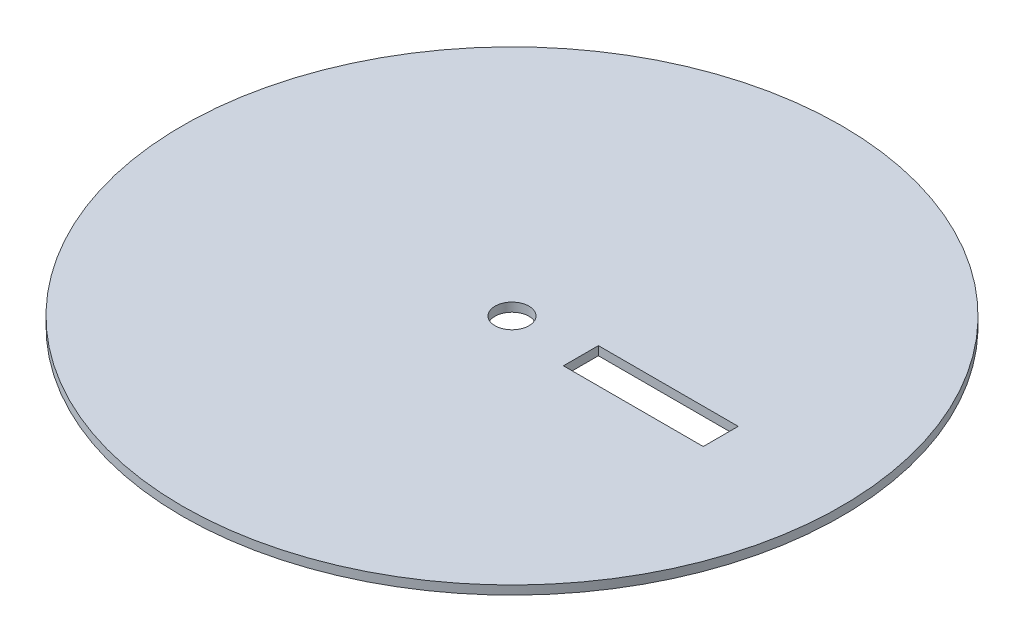
ISO-10303-21;
HEADER;
FILE_DESCRIPTION(('STEP AP214'),'2;1');
FILE_NAME('part.step','',(''),(''),'','','');
FILE_SCHEMA(('AUTOMOTIVE_DESIGN { 1 0 10303 214 1 1 1 1 }'));
ENDSEC;
DATA;
#1=APPLICATION_CONTEXT('core data for automotive mechanical design processes');
#2=APPLICATION_PROTOCOL_DEFINITION('international standard','automotive_design',2000,#1);
#3=PRODUCT_CONTEXT('',#1,'mechanical');
#4=PRODUCT('Part','Part','',(#3));
#5=PRODUCT_RELATED_PRODUCT_CATEGORY('part','',(#4));
#6=PRODUCT_DEFINITION_FORMATION('','',#4);
#7=PRODUCT_DEFINITION_CONTEXT('part definition',#1,'design');
#8=PRODUCT_DEFINITION('design','',#6,#7);
#9=PRODUCT_DEFINITION_SHAPE('','',#8);
#10=(LENGTH_UNIT() NAMED_UNIT(*) SI_UNIT(.MILLI.,.METRE.));
#11=(NAMED_UNIT(*) PLANE_ANGLE_UNIT() SI_UNIT($,.RADIAN.));
#12=(NAMED_UNIT(*) SI_UNIT($,.STERADIAN.) SOLID_ANGLE_UNIT());
#13=UNCERTAINTY_MEASURE_WITH_UNIT(LENGTH_MEASURE(1.E-05),#10,'distance_accuracy_value','');
#14=(GEOMETRIC_REPRESENTATION_CONTEXT(3) GLOBAL_UNCERTAINTY_ASSIGNED_CONTEXT((#13)) GLOBAL_UNIT_ASSIGNED_CONTEXT((#10,
#11,#12)) REPRESENTATION_CONTEXT('',''));
#15=CARTESIAN_POINT('',(0.,0.,0.));
#16=DIRECTION('',(0.,0.,1.));
#17=DIRECTION('',(1.,0.,0.));
#18=AXIS2_PLACEMENT_3D('',#15,#16,#17);
#19=CARTESIAN_POINT('',(0.,0.44,0.));
#20=DIRECTION('',(0.,-1.,0.));
#21=DIRECTION('',(0.,0.,-1.));
#22=AXIS2_PLACEMENT_3D('',#19,#20,#21);
#23=CYLINDRICAL_SURFACE('',#22,16.5);
#24=CARTESIAN_POINT('',(0.,0.44,0.));
#25=DIRECTION('',(0.,1.,0.));
#26=DIRECTION('',(0.,0.,1.));
#27=AXIS2_PLACEMENT_3D('',#24,#25,#26);
#28=CIRCLE('',#27,16.5);
#29=CARTESIAN_POINT('',(0.,0.44,16.5));
#30=VERTEX_POINT('',#29);
#31=EDGE_CURVE('E11',#30,#30,#28,.T.);
#32=ORIENTED_EDGE('',*,*,#31,.F.);
#33=EDGE_LOOP('',(#32));
#34=FACE_BOUND('',#33,.T.);
#35=CARTESIAN_POINT('',(0.,0.,0.));
#36=DIRECTION('',(0.,1.,0.));
#37=DIRECTION('',(0.,0.,1.));
#38=AXIS2_PLACEMENT_3D('',#35,#36,#37);
#39=CIRCLE('',#38,16.5);
#40=CARTESIAN_POINT('',(0.,0.,16.5));
#41=VERTEX_POINT('',#40);
#42=EDGE_CURVE('E36',#41,#41,#39,.T.);
#43=ORIENTED_EDGE('',*,*,#42,.T.);
#44=EDGE_LOOP('',(#43));
#45=FACE_BOUND('',#44,.T.);
#46=ADVANCED_FACE('F33',(#34,#45),#23,.T.);
#47=CARTESIAN_POINT('',(0.,0.44,0.));
#48=DIRECTION('',(0.,1.,0.));
#49=DIRECTION('',(0.,0.,1.));
#50=AXIS2_PLACEMENT_3D('',#47,#48,#49);
#51=PLANE('',#50);
#52=CARTESIAN_POINT('',(0.,0.44,0.));
#53=DIRECTION('',(0.,1.,0.));
#54=DIRECTION('',(0.,0.,1.));
#55=AXIS2_PLACEMENT_3D('',#52,#53,#54);
#56=CIRCLE('',#55,0.85);
#57=CARTESIAN_POINT('',(0.,0.44,0.85));
#58=VERTEX_POINT('',#57);
#59=EDGE_CURVE('E97',#58,#58,#56,.T.);
#60=ORIENTED_EDGE('',*,*,#59,.F.);
#61=EDGE_LOOP('',(#60));
#62=FACE_BOUND('',#61,.T.);
#63=DIRECTION('',(0.,0.,-1.));
#64=VECTOR('',#63,1.);
#65=CARTESIAN_POINT('',(10.45,0.44,-0.875));
#66=LINE('',#65,#64);
#67=CARTESIAN_POINT('',(10.45,0.44,0.875));
#68=VERTEX_POINT('',#67);
#69=CARTESIAN_POINT('',(10.45,0.44,-0.875));
#70=VERTEX_POINT('',#69);
#71=EDGE_CURVE('E47',#68,#70,#66,.T.);
#72=ORIENTED_EDGE('',*,*,#71,.F.);
#73=DIRECTION('',(1.,0.,0.));
#74=VECTOR('',#73,1.);
#75=CARTESIAN_POINT('',(3.45,0.44,0.875));
#76=LINE('',#75,#74);
#77=CARTESIAN_POINT('',(3.45,0.44,0.875));
#78=VERTEX_POINT('',#77);
#79=EDGE_CURVE('E91',#78,#68,#76,.T.);
#80=ORIENTED_EDGE('',*,*,#79,.F.);
#81=DIRECTION('',(0.,0.,1.));
#82=VECTOR('',#81,1.);
#83=CARTESIAN_POINT('',(3.45,0.44,-0.875));
#84=LINE('',#83,#82);
#85=CARTESIAN_POINT('',(3.45,0.44,-0.875));
#86=VERTEX_POINT('',#85);
#87=EDGE_CURVE('E94',#86,#78,#84,.T.);
#88=ORIENTED_EDGE('',*,*,#87,.F.);
#89=DIRECTION('',(-1.,0.,0.));
#90=VECTOR('',#89,1.);
#91=CARTESIAN_POINT('',(3.45,0.44,-0.875));
#92=LINE('',#91,#90);
#93=EDGE_CURVE('E103',#70,#86,#92,.T.);
#94=ORIENTED_EDGE('',*,*,#93,.F.);
#95=EDGE_LOOP('',(#72,#80,#88,#94));
#96=FACE_BOUND('',#95,.T.);
#97=ORIENTED_EDGE('',*,*,#31,.T.);
#98=EDGE_LOOP('',(#97));
#99=FACE_BOUND('',#98,.T.);
#100=ADVANCED_FACE('F115',(#62,#96,#99),#51,.T.);
#101=CARTESIAN_POINT('',(0.,0.,0.));
#102=DIRECTION('',(0.,1.,0.));
#103=DIRECTION('',(0.,0.,1.));
#104=AXIS2_PLACEMENT_3D('',#101,#102,#103);
#105=PLANE('',#104);
#106=CARTESIAN_POINT('',(0.,0.,0.));
#107=DIRECTION('',(0.,1.,0.));
#108=DIRECTION('',(0.,0.,1.));
#109=AXIS2_PLACEMENT_3D('',#106,#107,#108);
#110=CIRCLE('',#109,0.85);
#111=CARTESIAN_POINT('',(0.,0.,0.85));
#112=VERTEX_POINT('',#111);
#113=EDGE_CURVE('E139',#112,#112,#110,.T.);
#114=ORIENTED_EDGE('',*,*,#113,.T.);
#115=EDGE_LOOP('',(#114));
#116=FACE_BOUND('',#115,.T.);
#117=DIRECTION('',(1.,0.,0.));
#118=VECTOR('',#117,1.);
#119=CARTESIAN_POINT('',(3.45,0.,0.875));
#120=LINE('',#119,#118);
#121=CARTESIAN_POINT('',(3.45,0.,0.875));
#122=VERTEX_POINT('',#121);
#123=CARTESIAN_POINT('',(10.45,0.,0.875));
#124=VERTEX_POINT('',#123);
#125=EDGE_CURVE('E81',#122,#124,#120,.T.);
#126=ORIENTED_EDGE('',*,*,#125,.T.);
#127=DIRECTION('',(0.,0.,-1.));
#128=VECTOR('',#127,1.);
#129=CARTESIAN_POINT('',(10.45,0.,-0.875));
#130=LINE('',#129,#128);
#131=CARTESIAN_POINT('',(10.45,0.,-0.875));
#132=VERTEX_POINT('',#131);
#133=EDGE_CURVE('E75',#124,#132,#130,.T.);
#134=ORIENTED_EDGE('',*,*,#133,.T.);
#135=DIRECTION('',(-1.,0.,0.));
#136=VECTOR('',#135,1.);
#137=CARTESIAN_POINT('',(3.45,0.,-0.875));
#138=LINE('',#137,#136);
#139=CARTESIAN_POINT('',(3.45,0.,-0.875));
#140=VERTEX_POINT('',#139);
#141=EDGE_CURVE('E84',#132,#140,#138,.T.);
#142=ORIENTED_EDGE('',*,*,#141,.T.);
#143=DIRECTION('',(0.,0.,1.));
#144=VECTOR('',#143,1.);
#145=CARTESIAN_POINT('',(3.45,0.,-0.875));
#146=LINE('',#145,#144);
#147=EDGE_CURVE('E55',#140,#122,#146,.T.);
#148=ORIENTED_EDGE('',*,*,#147,.T.);
#149=EDGE_LOOP('',(#126,#134,#142,#148));
#150=FACE_BOUND('',#149,.T.);
#151=ORIENTED_EDGE('',*,*,#42,.F.);
#152=EDGE_LOOP('',(#151));
#153=FACE_BOUND('',#152,.T.);
#154=ADVANCED_FACE('F88',(#116,#150,#153),#105,.F.);
#155=CARTESIAN_POINT('',(10.45,0.,-0.875));
#156=DIRECTION('',(1.,0.,0.));
#157=DIRECTION('',(0.,0.,-1.));
#158=AXIS2_PLACEMENT_3D('',#155,#156,#157);
#159=PLANE('',#158);
#160=ORIENTED_EDGE('',*,*,#71,.T.);
#161=DIRECTION('',(0.,1.,0.));
#162=VECTOR('',#161,1.);
#163=CARTESIAN_POINT('',(10.45,0.,-0.875));
#164=LINE('',#163,#162);
#165=EDGE_CURVE('E71',#132,#70,#164,.T.);
#166=ORIENTED_EDGE('',*,*,#165,.F.);
#167=ORIENTED_EDGE('',*,*,#133,.F.);
#168=DIRECTION('',(0.,1.,0.));
#169=VECTOR('',#168,1.);
#170=CARTESIAN_POINT('',(10.45,0.,0.875));
#171=LINE('',#170,#169);
#172=EDGE_CURVE('E107',#124,#68,#171,.T.);
#173=ORIENTED_EDGE('',*,*,#172,.T.);
#174=EDGE_LOOP('',(#160,#166,#167,#173));
#175=FACE_BOUND('',#174,.T.);
#176=ADVANCED_FACE('F73',(#175),#159,.F.);
#177=CARTESIAN_POINT('',(3.45,0.,0.875));
#178=DIRECTION('',(0.,0.,1.));
#179=DIRECTION('',(1.,0.,0.));
#180=AXIS2_PLACEMENT_3D('',#177,#178,#179);
#181=PLANE('',#180);
#182=ORIENTED_EDGE('',*,*,#79,.T.);
#183=ORIENTED_EDGE('',*,*,#172,.F.);
#184=ORIENTED_EDGE('',*,*,#125,.F.);
#185=DIRECTION('',(0.,1.,0.));
#186=VECTOR('',#185,1.);
#187=CARTESIAN_POINT('',(3.45,0.,0.875));
#188=LINE('',#187,#186);
#189=EDGE_CURVE('E109',#122,#78,#188,.T.);
#190=ORIENTED_EDGE('',*,*,#189,.T.);
#191=EDGE_LOOP('',(#182,#183,#184,#190));
#192=FACE_BOUND('',#191,.T.);
#193=ADVANCED_FACE('F118',(#192),#181,.F.);
#194=CARTESIAN_POINT('',(3.45,0.,-0.875));
#195=DIRECTION('',(-1.,0.,0.));
#196=DIRECTION('',(0.,0.,1.));
#197=AXIS2_PLACEMENT_3D('',#194,#195,#196);
#198=PLANE('',#197);
#199=ORIENTED_EDGE('',*,*,#87,.T.);
#200=ORIENTED_EDGE('',*,*,#189,.F.);
#201=ORIENTED_EDGE('',*,*,#147,.F.);
#202=DIRECTION('',(0.,1.,0.));
#203=VECTOR('',#202,1.);
#204=CARTESIAN_POINT('',(3.45,0.,-0.875));
#205=LINE('',#204,#203);
#206=EDGE_CURVE('E80',#140,#86,#205,.T.);
#207=ORIENTED_EDGE('',*,*,#206,.T.);
#208=EDGE_LOOP('',(#199,#200,#201,#207));
#209=FACE_BOUND('',#208,.T.);
#210=ADVANCED_FACE('F111',(#209),#198,.F.);
#211=CARTESIAN_POINT('',(3.45,0.,-0.875));
#212=DIRECTION('',(0.,0.,-1.));
#213=DIRECTION('',(-1.,0.,0.));
#214=AXIS2_PLACEMENT_3D('',#211,#212,#213);
#215=PLANE('',#214);
#216=ORIENTED_EDGE('',*,*,#93,.T.);
#217=ORIENTED_EDGE('',*,*,#206,.F.);
#218=ORIENTED_EDGE('',*,*,#141,.F.);
#219=ORIENTED_EDGE('',*,*,#165,.T.);
#220=EDGE_LOOP('',(#216,#217,#218,#219));
#221=FACE_BOUND('',#220,.T.);
#222=ADVANCED_FACE('F85',(#221),#215,.F.);
#223=CARTESIAN_POINT('',(0.,0.,0.));
#224=DIRECTION('',(0.,1.,0.));
#225=DIRECTION('',(0.,0.,1.));
#226=AXIS2_PLACEMENT_3D('',#223,#224,#225);
#227=CYLINDRICAL_SURFACE('',#226,0.85);
#228=ORIENTED_EDGE('',*,*,#113,.F.);
#229=EDGE_LOOP('',(#228));
#230=FACE_BOUND('',#229,.T.);
#231=ORIENTED_EDGE('',*,*,#59,.T.);
#232=EDGE_LOOP('',(#231));
#233=FACE_BOUND('',#232,.T.);
#234=ADVANCED_FACE('F146',(#230,#233),#227,.F.);
#235=CLOSED_SHELL('',(#46,#100,#154,#176,#193,#210,#222,#234));
#236=MANIFOLD_SOLID_BREP('B2',#235);
#237=ADVANCED_BREP_SHAPE_REPRESENTATION('',(#18,#236),#14);
#238=SHAPE_DEFINITION_REPRESENTATION(#9,#237);
ENDSEC;
END-ISO-10303-21;
